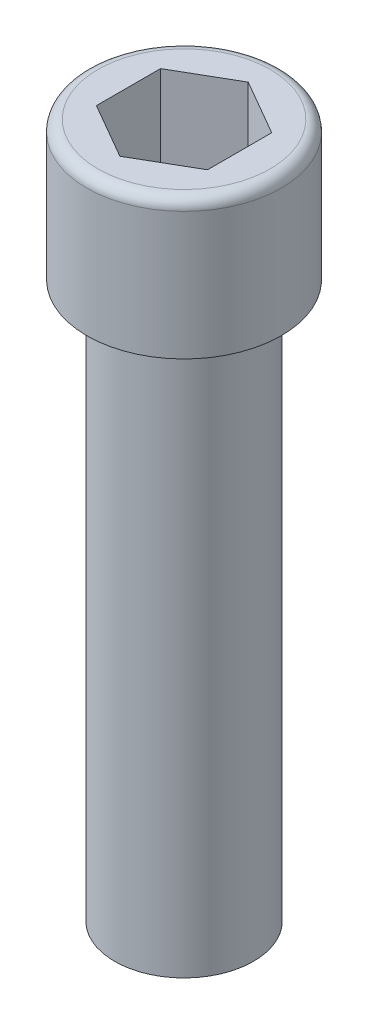
ISO-10303-21;
HEADER;
FILE_DESCRIPTION(('STEP AP214'),'2;1');
FILE_NAME('part.step','',(''),(''),'','','');
FILE_SCHEMA(('AUTOMOTIVE_DESIGN { 1 0 10303 214 1 1 1 1 }'));
ENDSEC;
DATA;
#1=APPLICATION_CONTEXT('core data for automotive mechanical design processes');
#2=APPLICATION_PROTOCOL_DEFINITION('international standard','automotive_design',2000,#1);
#3=PRODUCT_CONTEXT('',#1,'mechanical');
#4=PRODUCT('Part','Part','',(#3));
#5=PRODUCT_RELATED_PRODUCT_CATEGORY('part','',(#4));
#6=PRODUCT_DEFINITION_FORMATION('','',#4);
#7=PRODUCT_DEFINITION_CONTEXT('part definition',#1,'design');
#8=PRODUCT_DEFINITION('design','',#6,#7);
#9=PRODUCT_DEFINITION_SHAPE('','',#8);
#10=(LENGTH_UNIT() NAMED_UNIT(*) SI_UNIT(.MILLI.,.METRE.));
#11=(NAMED_UNIT(*) PLANE_ANGLE_UNIT() SI_UNIT($,.RADIAN.));
#12=(NAMED_UNIT(*) SI_UNIT($,.STERADIAN.) SOLID_ANGLE_UNIT());
#13=UNCERTAINTY_MEASURE_WITH_UNIT(LENGTH_MEASURE(1.E-05),#10,'distance_accuracy_value','');
#14=(GEOMETRIC_REPRESENTATION_CONTEXT(3) GLOBAL_UNCERTAINTY_ASSIGNED_CONTEXT((#13)) GLOBAL_UNIT_ASSIGNED_CONTEXT((#10,
#11,#12)) REPRESENTATION_CONTEXT('',''));
#15=CARTESIAN_POINT('',(0.,0.,0.));
#16=DIRECTION('',(0.,0.,1.));
#17=DIRECTION('',(1.,0.,0.));
#18=AXIS2_PLACEMENT_3D('',#15,#16,#17);
#19=CARTESIAN_POINT('',(0.,2.5,0.));
#20=DIRECTION('',(0.,-1.,0.));
#21=DIRECTION('',(0.,0.,-1.));
#22=AXIS2_PLACEMENT_3D('',#19,#20,#21);
#23=CYLINDRICAL_SURFACE('',#22,1.75);
#24=CARTESIAN_POINT('',(0.,2.3,0.));
#25=DIRECTION('',(0.,1.,0.));
#26=DIRECTION('',(0.,0.,1.));
#27=AXIS2_PLACEMENT_3D('',#24,#25,#26);
#28=CIRCLE('',#27,1.75);
#29=CARTESIAN_POINT('',(0.,2.3,1.75));
#30=VERTEX_POINT('',#29);
#31=EDGE_CURVE('E11',#30,#30,#28,.F.);
#32=ORIENTED_EDGE('',*,*,#31,.T.);
#33=EDGE_LOOP('',(#32));
#34=FACE_BOUND('',#33,.T.);
#35=CARTESIAN_POINT('',(0.,0.,0.));
#36=DIRECTION('',(0.,1.,0.));
#37=DIRECTION('',(0.,0.,1.));
#38=AXIS2_PLACEMENT_3D('',#35,#36,#37);
#39=CIRCLE('',#38,1.75);
#40=CARTESIAN_POINT('',(0.,0.,1.75));
#41=VERTEX_POINT('',#40);
#42=EDGE_CURVE('E169',#41,#41,#39,.T.);
#43=ORIENTED_EDGE('',*,*,#42,.T.);
#44=EDGE_LOOP('',(#43));
#45=FACE_BOUND('',#44,.T.);
#46=ADVANCED_FACE('F41',(#34,#45),#23,.T.);
#47=CARTESIAN_POINT('',(0.,2.5,0.));
#48=DIRECTION('',(0.,1.,0.));
#49=DIRECTION('',(0.,0.,1.));
#50=AXIS2_PLACEMENT_3D('',#47,#48,#49);
#51=PLANE('',#50);
#52=DIRECTION('',(0.866025403784439,0.,0.5));
#53=VECTOR('',#52,1.);
#54=CARTESIAN_POINT('',(-1.,2.5,0.577350269189626));
#55=LINE('',#54,#53);
#56=CARTESIAN_POINT('',(-1.,2.5,0.577350269189626));
#57=VERTEX_POINT('',#56);
#58=CARTESIAN_POINT('',(0.,2.5,1.15470053837925));
#59=VERTEX_POINT('',#58);
#60=EDGE_CURVE('E57',#57,#59,#55,.T.);
#61=ORIENTED_EDGE('',*,*,#60,.F.);
#62=DIRECTION('',(0.,0.,1.));
#63=VECTOR('',#62,1.);
#64=CARTESIAN_POINT('',(-1.,2.5,-0.577350269189626));
#65=LINE('',#64,#63);
#66=CARTESIAN_POINT('',(-1.,2.5,-0.577350269189626));
#67=VERTEX_POINT('',#66);
#68=EDGE_CURVE('E150',#67,#57,#65,.T.);
#69=ORIENTED_EDGE('',*,*,#68,.F.);
#70=DIRECTION('',(-0.866025403784439,0.,0.5));
#71=VECTOR('',#70,1.);
#72=CARTESIAN_POINT('',(0.,2.5,-1.15470053837925));
#73=LINE('',#72,#71);
#74=CARTESIAN_POINT('',(0.,2.5,-1.15470053837925));
#75=VERTEX_POINT('',#74);
#76=EDGE_CURVE('E147',#75,#67,#73,.T.);
#77=ORIENTED_EDGE('',*,*,#76,.F.);
#78=DIRECTION('',(-0.866025403784439,0.,-0.5));
#79=VECTOR('',#78,1.);
#80=CARTESIAN_POINT('',(1.,2.5,-0.577350269189626));
#81=LINE('',#80,#79);
#82=CARTESIAN_POINT('',(1.,2.5,-0.577350269189626));
#83=VERTEX_POINT('',#82);
#84=EDGE_CURVE('E105',#83,#75,#81,.T.);
#85=ORIENTED_EDGE('',*,*,#84,.F.);
#86=DIRECTION('',(0.,0.,-1.));
#87=VECTOR('',#86,1.);
#88=CARTESIAN_POINT('',(1.,2.5,0.577350269189626));
#89=LINE('',#88,#87);
#90=CARTESIAN_POINT('',(1.,2.5,0.577350269189626));
#91=VERTEX_POINT('',#90);
#92=EDGE_CURVE('E141',#91,#83,#89,.T.);
#93=ORIENTED_EDGE('',*,*,#92,.F.);
#94=DIRECTION('',(0.866025403784439,0.,-0.5));
#95=VECTOR('',#94,1.);
#96=CARTESIAN_POINT('',(0.,2.5,1.15470053837925));
#97=LINE('',#96,#95);
#98=EDGE_CURVE('E137',#59,#91,#97,.T.);
#99=ORIENTED_EDGE('',*,*,#98,.F.);
#100=EDGE_LOOP('',(#61,#69,#77,#85,#93,#99));
#101=FACE_BOUND('',#100,.T.);
#102=CARTESIAN_POINT('',(0.,2.5,0.));
#103=DIRECTION('',(0.,1.,0.));
#104=DIRECTION('',(0.,0.,1.));
#105=AXIS2_PLACEMENT_3D('',#102,#103,#104);
#106=CIRCLE('',#105,1.55);
#107=CARTESIAN_POINT('',(0.,2.5,1.55));
#108=VERTEX_POINT('',#107);
#109=EDGE_CURVE('E50',#108,#108,#106,.T.);
#110=ORIENTED_EDGE('',*,*,#109,.T.);
#111=EDGE_LOOP('',(#110));
#112=FACE_BOUND('',#111,.T.);
#113=ADVANCED_FACE('F180',(#101,#112),#51,.T.);
#114=CARTESIAN_POINT('',(0.,0.,0.));
#115=DIRECTION('',(0.,1.,0.));
#116=DIRECTION('',(0.,0.,1.));
#117=AXIS2_PLACEMENT_3D('',#114,#115,#116);
#118=PLANE('',#117);
#119=CARTESIAN_POINT('',(0.,0.,0.));
#120=DIRECTION('',(0.,-1.,0.));
#121=DIRECTION('',(0.,0.,-1.));
#122=AXIS2_PLACEMENT_3D('',#119,#120,#121);
#123=CIRCLE('',#122,1.25);
#124=CARTESIAN_POINT('',(0.,0.,-1.25));
#125=VERTEX_POINT('',#124);
#126=EDGE_CURVE('E170',#125,#125,#123,.T.);
#127=ORIENTED_EDGE('',*,*,#126,.F.);
#128=EDGE_LOOP('',(#127));
#129=FACE_BOUND('',#128,.T.);
#130=ORIENTED_EDGE('',*,*,#42,.F.);
#131=EDGE_LOOP('',(#130));
#132=FACE_BOUND('',#131,.T.);
#133=ADVANCED_FACE('F201',(#129,#132),#118,.F.);
#134=CARTESIAN_POINT('',(0.,-10.,0.));
#135=DIRECTION('',(0.,1.,0.));
#136=DIRECTION('',(0.,0.,1.));
#137=AXIS2_PLACEMENT_3D('',#134,#135,#136);
#138=CYLINDRICAL_SURFACE('',#137,1.25);
#139=CARTESIAN_POINT('',(0.,-10.,0.));
#140=DIRECTION('',(0.,-1.,0.));
#141=DIRECTION('',(0.,0.,-1.));
#142=AXIS2_PLACEMENT_3D('',#139,#140,#141);
#143=CIRCLE('',#142,1.25);
#144=CARTESIAN_POINT('',(0.,-10.,-1.25));
#145=VERTEX_POINT('',#144);
#146=EDGE_CURVE('E156',#145,#145,#143,.T.);
#147=ORIENTED_EDGE('',*,*,#146,.F.);
#148=EDGE_LOOP('',(#147));
#149=FACE_BOUND('',#148,.T.);
#150=ORIENTED_EDGE('',*,*,#126,.T.);
#151=EDGE_LOOP('',(#150));
#152=FACE_BOUND('',#151,.T.);
#153=ADVANCED_FACE('F192',(#149,#152),#138,.T.);
#154=CARTESIAN_POINT('',(0.,-10.,0.));
#155=DIRECTION('',(0.,-1.,0.));
#156=DIRECTION('',(0.,0.,-1.));
#157=AXIS2_PLACEMENT_3D('',#154,#155,#156);
#158=PLANE('',#157);
#159=ORIENTED_EDGE('',*,*,#146,.T.);
#160=EDGE_LOOP('',(#159));
#161=FACE_BOUND('',#160,.T.);
#162=ADVANCED_FACE('F184',(#161),#158,.T.);
#163=CARTESIAN_POINT('',(0.,2.3,0.));
#164=DIRECTION('',(0.,1.,0.));
#165=DIRECTION('',(0.,0.,1.));
#166=AXIS2_PLACEMENT_3D('',#163,#164,#165);
#167=TOROIDAL_SURFACE('',#166,1.55,0.2);
#168=ORIENTED_EDGE('',*,*,#31,.F.);
#169=EDGE_LOOP('',(#168));
#170=FACE_BOUND('',#169,.T.);
#171=ORIENTED_EDGE('',*,*,#109,.F.);
#172=EDGE_LOOP('',(#171));
#173=FACE_BOUND('',#172,.T.);
#174=ADVANCED_FACE('F43',(#170,#173),#167,.T.);
#175=CARTESIAN_POINT('',(-1.,1.,0.577350269189626));
#176=DIRECTION('',(-0.5,0.,0.866025403784439));
#177=DIRECTION('',(0.866025403784439,0.,0.5));
#178=AXIS2_PLACEMENT_3D('',#175,#176,#177);
#179=PLANE('',#178);
#180=ORIENTED_EDGE('',*,*,#60,.T.);
#181=DIRECTION('',(0.,1.,0.));
#182=VECTOR('',#181,1.);
#183=CARTESIAN_POINT('',(0.,1.,1.15470053837925));
#184=LINE('',#183,#182);
#185=CARTESIAN_POINT('',(0.,1.,1.15470053837925));
#186=VERTEX_POINT('',#185);
#187=EDGE_CURVE('E87',#186,#59,#184,.T.);
#188=ORIENTED_EDGE('',*,*,#187,.F.);
#189=DIRECTION('',(0.866025403784439,0.,0.5));
#190=VECTOR('',#189,1.);
#191=CARTESIAN_POINT('',(-1.,1.,0.577350269189626));
#192=LINE('',#191,#190);
#193=CARTESIAN_POINT('',(-1.,1.,0.577350269189626));
#194=VERTEX_POINT('',#193);
#195=EDGE_CURVE('E153',#194,#186,#192,.T.);
#196=ORIENTED_EDGE('',*,*,#195,.F.);
#197=DIRECTION('',(0.,1.,0.));
#198=VECTOR('',#197,1.);
#199=CARTESIAN_POINT('',(-1.,1.,0.577350269189626));
#200=LINE('',#199,#198);
#201=EDGE_CURVE('E65',#194,#57,#200,.T.);
#202=ORIENTED_EDGE('',*,*,#201,.T.);
#203=EDGE_LOOP('',(#180,#188,#196,#202));
#204=FACE_BOUND('',#203,.T.);
#205=ADVANCED_FACE('F183',(#204),#179,.F.);
#206=CARTESIAN_POINT('',(-1.,1.,-0.577350269189626));
#207=DIRECTION('',(-1.,0.,0.));
#208=DIRECTION('',(0.,0.,1.));
#209=AXIS2_PLACEMENT_3D('',#206,#207,#208);
#210=PLANE('',#209);
#211=ORIENTED_EDGE('',*,*,#68,.T.);
#212=ORIENTED_EDGE('',*,*,#201,.F.);
#213=DIRECTION('',(0.,0.,1.));
#214=VECTOR('',#213,1.);
#215=CARTESIAN_POINT('',(-1.,1.,-0.577350269189626));
#216=LINE('',#215,#214);
#217=CARTESIAN_POINT('',(-1.,1.,-0.577350269189626));
#218=VERTEX_POINT('',#217);
#219=EDGE_CURVE('E119',#218,#194,#216,.T.);
#220=ORIENTED_EDGE('',*,*,#219,.F.);
#221=DIRECTION('',(0.,1.,0.));
#222=VECTOR('',#221,1.);
#223=CARTESIAN_POINT('',(-1.,1.,-0.577350269189626));
#224=LINE('',#223,#222);
#225=EDGE_CURVE('E110',#218,#67,#224,.T.);
#226=ORIENTED_EDGE('',*,*,#225,.T.);
#227=EDGE_LOOP('',(#211,#212,#220,#226));
#228=FACE_BOUND('',#227,.T.);
#229=ADVANCED_FACE('F190',(#228),#210,.F.);
#230=CARTESIAN_POINT('',(0.,1.,-1.15470053837925));
#231=DIRECTION('',(-0.5,0.,-0.866025403784439));
#232=DIRECTION('',(-0.866025403784439,0.,0.5));
#233=AXIS2_PLACEMENT_3D('',#230,#231,#232);
#234=PLANE('',#233);
#235=ORIENTED_EDGE('',*,*,#76,.T.);
#236=ORIENTED_EDGE('',*,*,#225,.F.);
#237=DIRECTION('',(-0.866025403784439,0.,0.5));
#238=VECTOR('',#237,1.);
#239=CARTESIAN_POINT('',(0.,1.,-1.15470053837925));
#240=LINE('',#239,#238);
#241=CARTESIAN_POINT('',(0.,1.,-1.15470053837925));
#242=VERTEX_POINT('',#241);
#243=EDGE_CURVE('E114',#242,#218,#240,.T.);
#244=ORIENTED_EDGE('',*,*,#243,.F.);
#245=DIRECTION('',(0.,1.,0.));
#246=VECTOR('',#245,1.);
#247=CARTESIAN_POINT('',(0.,1.,-1.15470053837925));
#248=LINE('',#247,#246);
#249=EDGE_CURVE('E98',#242,#75,#248,.T.);
#250=ORIENTED_EDGE('',*,*,#249,.T.);
#251=EDGE_LOOP('',(#235,#236,#244,#250));
#252=FACE_BOUND('',#251,.T.);
#253=ADVANCED_FACE('F115',(#252),#234,.F.);
#254=CARTESIAN_POINT('',(1.,1.,-0.577350269189626));
#255=DIRECTION('',(0.5,0.,-0.866025403784438));
#256=DIRECTION('',(-0.866025403784439,0.,-0.5));
#257=AXIS2_PLACEMENT_3D('',#254,#255,#256);
#258=PLANE('',#257);
#259=ORIENTED_EDGE('',*,*,#84,.T.);
#260=ORIENTED_EDGE('',*,*,#249,.F.);
#261=DIRECTION('',(-0.866025403784439,0.,-0.5));
#262=VECTOR('',#261,1.);
#263=CARTESIAN_POINT('',(1.,1.,-0.577350269189626));
#264=LINE('',#263,#262);
#265=CARTESIAN_POINT('',(1.,1.,-0.577350269189626));
#266=VERTEX_POINT('',#265);
#267=EDGE_CURVE('E102',#266,#242,#264,.T.);
#268=ORIENTED_EDGE('',*,*,#267,.F.);
#269=DIRECTION('',(0.,1.,0.));
#270=VECTOR('',#269,1.);
#271=CARTESIAN_POINT('',(1.,1.,-0.577350269189626));
#272=LINE('',#271,#270);
#273=EDGE_CURVE('E111',#266,#83,#272,.T.);
#274=ORIENTED_EDGE('',*,*,#273,.T.);
#275=EDGE_LOOP('',(#259,#260,#268,#274));
#276=FACE_BOUND('',#275,.T.);
#277=ADVANCED_FACE('F100',(#276),#258,.F.);
#278=CARTESIAN_POINT('',(1.,1.,0.577350269189626));
#279=DIRECTION('',(1.,0.,0.));
#280=DIRECTION('',(0.,0.,-1.));
#281=AXIS2_PLACEMENT_3D('',#278,#279,#280);
#282=PLANE('',#281);
#283=ORIENTED_EDGE('',*,*,#92,.T.);
#284=ORIENTED_EDGE('',*,*,#273,.F.);
#285=DIRECTION('',(0.,0.,-1.));
#286=VECTOR('',#285,1.);
#287=CARTESIAN_POINT('',(1.,1.,0.577350269189626));
#288=LINE('',#287,#286);
#289=CARTESIAN_POINT('',(1.,1.,0.577350269189626));
#290=VERTEX_POINT('',#289);
#291=EDGE_CURVE('E125',#290,#266,#288,.T.);
#292=ORIENTED_EDGE('',*,*,#291,.F.);
#293=DIRECTION('',(0.,1.,0.));
#294=VECTOR('',#293,1.);
#295=CARTESIAN_POINT('',(1.,1.,0.577350269189626));
#296=LINE('',#295,#294);
#297=EDGE_CURVE('E161',#290,#91,#296,.T.);
#298=ORIENTED_EDGE('',*,*,#297,.T.);
#299=EDGE_LOOP('',(#283,#284,#292,#298));
#300=FACE_BOUND('',#299,.T.);
#301=ADVANCED_FACE('F215',(#300),#282,.F.);
#302=CARTESIAN_POINT('',(0.,1.,1.15470053837925));
#303=DIRECTION('',(0.5,0.,0.866025403784439));
#304=DIRECTION('',(0.866025403784439,0.,-0.5));
#305=AXIS2_PLACEMENT_3D('',#302,#303,#304);
#306=PLANE('',#305);
#307=ORIENTED_EDGE('',*,*,#98,.T.);
#308=ORIENTED_EDGE('',*,*,#297,.F.);
#309=DIRECTION('',(0.866025403784439,0.,-0.5));
#310=VECTOR('',#309,1.);
#311=CARTESIAN_POINT('',(0.,1.,1.15470053837925));
#312=LINE('',#311,#310);
#313=EDGE_CURVE('E129',#186,#290,#312,.T.);
#314=ORIENTED_EDGE('',*,*,#313,.F.);
#315=ORIENTED_EDGE('',*,*,#187,.T.);
#316=EDGE_LOOP('',(#307,#308,#314,#315));
#317=FACE_BOUND('',#316,.T.);
#318=ADVANCED_FACE('F212',(#317),#306,.F.);
#319=CARTESIAN_POINT('',(0.,1.,0.));
#320=DIRECTION('',(0.,1.,0.));
#321=DIRECTION('',(0.,0.,1.));
#322=AXIS2_PLACEMENT_3D('',#319,#320,#321);
#323=PLANE('',#322);
#324=ORIENTED_EDGE('',*,*,#195,.T.);
#325=ORIENTED_EDGE('',*,*,#313,.T.);
#326=ORIENTED_EDGE('',*,*,#291,.T.);
#327=ORIENTED_EDGE('',*,*,#267,.T.);
#328=ORIENTED_EDGE('',*,*,#243,.T.);
#329=ORIENTED_EDGE('',*,*,#219,.T.);
#330=EDGE_LOOP('',(#324,#325,#326,#327,#328,#329));
#331=FACE_BOUND('',#330,.T.);
#332=ADVANCED_FACE('F122',(#331),#323,.T.);
#333=CLOSED_SHELL('',(#46,#113,#133,#153,#162,#174,#205,#229,#253,#277,#301,#318,#332));
#334=MANIFOLD_SOLID_BREP('B2',#333);
#335=ADVANCED_BREP_SHAPE_REPRESENTATION('',(#18,#334),#14);
#336=SHAPE_DEFINITION_REPRESENTATION(#9,#335);
ENDSEC;
END-ISO-10303-21;
